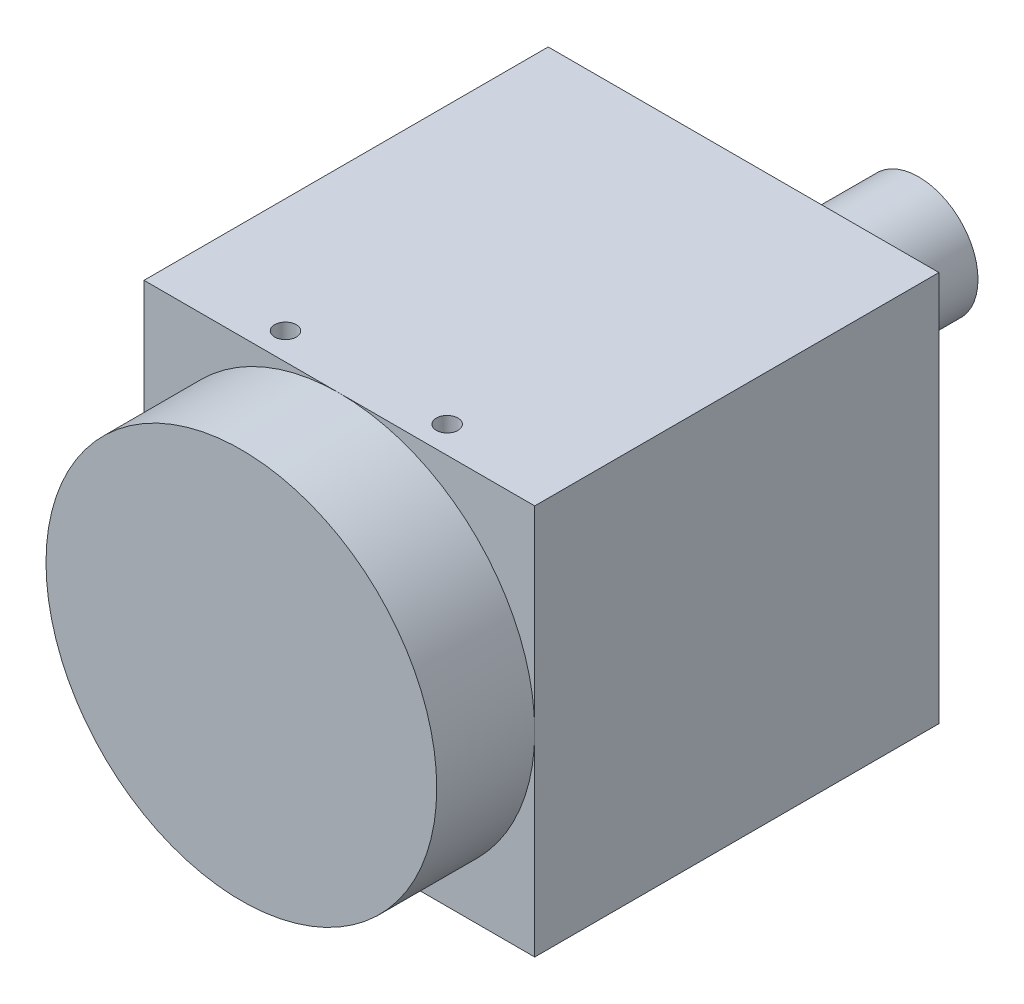
ISO-10303-21;
HEADER;
FILE_DESCRIPTION(('STEP AP214'),'2;1');
FILE_NAME('part.step','',(''),(''),'','','');
FILE_SCHEMA(('AUTOMOTIVE_DESIGN { 1 0 10303 214 1 1 1 1 }'));
ENDSEC;
DATA;
#1=APPLICATION_CONTEXT('core data for automotive mechanical design processes');
#2=APPLICATION_PROTOCOL_DEFINITION('international standard','automotive_design',2000,#1);
#3=PRODUCT_CONTEXT('',#1,'mechanical');
#4=PRODUCT('Part','Part','',(#3));
#5=PRODUCT_RELATED_PRODUCT_CATEGORY('part','',(#4));
#6=PRODUCT_DEFINITION_FORMATION('','',#4);
#7=PRODUCT_DEFINITION_CONTEXT('part definition',#1,'design');
#8=PRODUCT_DEFINITION('design','',#6,#7);
#9=PRODUCT_DEFINITION_SHAPE('','',#8);
#10=(LENGTH_UNIT() NAMED_UNIT(*) SI_UNIT(.MILLI.,.METRE.));
#11=(NAMED_UNIT(*) PLANE_ANGLE_UNIT() SI_UNIT($,.RADIAN.));
#12=(NAMED_UNIT(*) SI_UNIT($,.STERADIAN.) SOLID_ANGLE_UNIT());
#13=UNCERTAINTY_MEASURE_WITH_UNIT(LENGTH_MEASURE(1.E-05),#10,'distance_accuracy_value','');
#14=(GEOMETRIC_REPRESENTATION_CONTEXT(3) GLOBAL_UNCERTAINTY_ASSIGNED_CONTEXT((#13)) GLOBAL_UNIT_ASSIGNED_CONTEXT((#10,
#11,#12)) REPRESENTATION_CONTEXT('',''));
#15=CARTESIAN_POINT('',(0.,0.,0.));
#16=DIRECTION('',(0.,0.,1.));
#17=DIRECTION('',(1.,0.,0.));
#18=AXIS2_PLACEMENT_3D('',#15,#16,#17);
#19=CARTESIAN_POINT('',(0.,0.,15.));
#20=DIRECTION('',(0.,0.,1.));
#21=DIRECTION('',(1.,0.,0.));
#22=AXIS2_PLACEMENT_3D('',#19,#20,#21);
#23=PLANE('',#22);
#24=CARTESIAN_POINT('',(0.,0.,15.));
#25=DIRECTION('',(0.,0.,1.));
#26=DIRECTION('',(1.,0.,0.));
#27=AXIS2_PLACEMENT_3D('',#24,#25,#26);
#28=CIRCLE('',#27,14.5);
#29=CARTESIAN_POINT('',(14.5,0.,15.));
#30=VERTEX_POINT('',#29);
#31=CARTESIAN_POINT('',(0.,14.5,15.));
#32=VERTEX_POINT('',#31);
#33=EDGE_CURVE('E180',#30,#32,#28,.T.);
#34=ORIENTED_EDGE('',*,*,#33,.F.);
#35=DIRECTION('',(0.,1.,0.));
#36=VECTOR('',#35,1.);
#37=CARTESIAN_POINT('',(14.5,14.5,15.));
#38=LINE('',#37,#36);
#39=CARTESIAN_POINT('',(14.5,14.5,15.));
#40=VERTEX_POINT('',#39);
#41=EDGE_CURVE('E190',#30,#40,#38,.T.);
#42=ORIENTED_EDGE('',*,*,#41,.T.);
#43=DIRECTION('',(-1.,0.,0.));
#44=VECTOR('',#43,1.);
#45=CARTESIAN_POINT('',(-14.5,14.5,15.));
#46=LINE('',#45,#44);
#47=EDGE_CURVE('E191',#40,#32,#46,.T.);
#48=ORIENTED_EDGE('',*,*,#47,.T.);
#49=EDGE_LOOP('',(#34,#42,#48));
#50=FACE_BOUND('',#49,.T.);
#51=ADVANCED_FACE('F36',(#50),#23,.T.);
#52=CARTESIAN_POINT('',(-14.5,0.,15.));
#53=VERTEX_POINT('',#52);
#54=EDGE_CURVE('E44',#32,#53,#28,.T.);
#55=ORIENTED_EDGE('',*,*,#54,.F.);
#56=CARTESIAN_POINT('',(-14.5,14.5,15.));
#57=VERTEX_POINT('',#56);
#58=EDGE_CURVE('E189',#32,#57,#46,.T.);
#59=ORIENTED_EDGE('',*,*,#58,.T.);
#60=DIRECTION('',(0.,-1.,0.));
#61=VECTOR('',#60,1.);
#62=CARTESIAN_POINT('',(-14.5,14.5,15.));
#63=LINE('',#62,#61);
#64=EDGE_CURVE('E195',#57,#53,#63,.T.);
#65=ORIENTED_EDGE('',*,*,#64,.T.);
#66=EDGE_LOOP('',(#55,#59,#65));
#67=FACE_BOUND('',#66,.T.);
#68=ADVANCED_FACE('F228',(#67),#23,.T.);
#69=CARTESIAN_POINT('',(0.,-14.5,15.));
#70=VERTEX_POINT('',#69);
#71=EDGE_CURVE('E59',#53,#70,#28,.T.);
#72=ORIENTED_EDGE('',*,*,#71,.F.);
#73=CARTESIAN_POINT('',(-14.5,-14.5,15.));
#74=VERTEX_POINT('',#73);
#75=EDGE_CURVE('E194',#53,#74,#63,.T.);
#76=ORIENTED_EDGE('',*,*,#75,.T.);
#77=DIRECTION('',(1.,0.,0.));
#78=VECTOR('',#77,1.);
#79=CARTESIAN_POINT('',(-14.5,-14.5,15.));
#80=LINE('',#79,#78);
#81=EDGE_CURVE('E199',#74,#70,#80,.T.);
#82=ORIENTED_EDGE('',*,*,#81,.T.);
#83=EDGE_LOOP('',(#72,#76,#82));
#84=FACE_BOUND('',#83,.T.);
#85=ADVANCED_FACE('F246',(#84),#23,.T.);
#86=CARTESIAN_POINT('',(14.5,14.5,15.));
#87=DIRECTION('',(-1.,0.,0.));
#88=DIRECTION('',(0.,-1.,0.));
#89=AXIS2_PLACEMENT_3D('',#86,#87,#88);
#90=PLANE('',#89);
#91=DIRECTION('',(0.,1.,0.));
#92=VECTOR('',#91,1.);
#93=CARTESIAN_POINT('',(14.5,14.5,-15.));
#94=LINE('',#93,#92);
#95=CARTESIAN_POINT('',(14.5,-14.5,-15.));
#96=VERTEX_POINT('',#95);
#97=CARTESIAN_POINT('',(14.5,14.5,-15.));
#98=VERTEX_POINT('',#97);
#99=EDGE_CURVE('E184',#96,#98,#94,.T.);
#100=ORIENTED_EDGE('',*,*,#99,.T.);
#101=DIRECTION('',(0.,0.,-1.));
#102=VECTOR('',#101,1.);
#103=CARTESIAN_POINT('',(14.5,14.5,15.));
#104=LINE('',#103,#102);
#105=EDGE_CURVE('E217',#40,#98,#104,.T.);
#106=ORIENTED_EDGE('',*,*,#105,.F.);
#107=ORIENTED_EDGE('',*,*,#41,.F.);
#108=CARTESIAN_POINT('',(14.5,-14.5,15.));
#109=VERTEX_POINT('',#108);
#110=EDGE_CURVE('E187',#109,#30,#38,.T.);
#111=ORIENTED_EDGE('',*,*,#110,.F.);
#112=DIRECTION('',(0.,0.,-1.));
#113=VECTOR('',#112,1.);
#114=CARTESIAN_POINT('',(14.5,-14.5,15.));
#115=LINE('',#114,#113);
#116=EDGE_CURVE('E201',#109,#96,#115,.T.);
#117=ORIENTED_EDGE('',*,*,#116,.T.);
#118=EDGE_LOOP('',(#100,#106,#107,#111,#117));
#119=FACE_BOUND('',#118,.T.);
#120=ADVANCED_FACE('F38',(#119),#90,.F.);
#121=CARTESIAN_POINT('',(-14.5,14.5,15.));
#122=DIRECTION('',(0.,-1.,0.));
#123=DIRECTION('',(0.,0.,-1.));
#124=AXIS2_PLACEMENT_3D('',#121,#122,#123);
#125=PLANE('',#124);
#126=CARTESIAN_POINT('',(-6.,14.5,13.));
#127=DIRECTION('',(0.,1.,0.));
#128=DIRECTION('',(0.,0.,1.));
#129=AXIS2_PLACEMENT_3D('',#126,#127,#128);
#130=CIRCLE('',#129,0.79999999999999);
#131=CARTESIAN_POINT('',(-6.,14.5,13.8));
#132=VERTEX_POINT('',#131);
#133=EDGE_CURVE('E168',#132,#132,#130,.T.);
#134=ORIENTED_EDGE('',*,*,#133,.F.);
#135=EDGE_LOOP('',(#134));
#136=FACE_BOUND('',#135,.T.);
#137=CARTESIAN_POINT('',(6.,14.5,13.));
#138=DIRECTION('',(0.,1.,0.));
#139=DIRECTION('',(0.,0.,1.));
#140=AXIS2_PLACEMENT_3D('',#137,#138,#139);
#141=CIRCLE('',#140,0.79999999999999);
#142=CARTESIAN_POINT('',(6.,14.5,13.8));
#143=VERTEX_POINT('',#142);
#144=EDGE_CURVE('E174',#143,#143,#141,.T.);
#145=ORIENTED_EDGE('',*,*,#144,.F.);
#146=EDGE_LOOP('',(#145));
#147=FACE_BOUND('',#146,.T.);
#148=DIRECTION('',(-1.,0.,0.));
#149=VECTOR('',#148,1.);
#150=CARTESIAN_POINT('',(-14.5,14.5,-15.));
#151=LINE('',#150,#149);
#152=CARTESIAN_POINT('',(-14.5,14.5,-15.));
#153=VERTEX_POINT('',#152);
#154=EDGE_CURVE('E204',#98,#153,#151,.T.);
#155=ORIENTED_EDGE('',*,*,#154,.T.);
#156=DIRECTION('',(0.,0.,-1.));
#157=VECTOR('',#156,1.);
#158=CARTESIAN_POINT('',(-14.5,14.5,15.));
#159=LINE('',#158,#157);
#160=EDGE_CURVE('E215',#57,#153,#159,.T.);
#161=ORIENTED_EDGE('',*,*,#160,.F.);
#162=ORIENTED_EDGE('',*,*,#58,.F.);
#163=ORIENTED_EDGE('',*,*,#47,.F.);
#164=ORIENTED_EDGE('',*,*,#105,.T.);
#165=EDGE_LOOP('',(#155,#161,#162,#163,#164));
#166=FACE_BOUND('',#165,.T.);
#167=ADVANCED_FACE('F231',(#136,#147,#166),#125,.F.);
#168=CARTESIAN_POINT('',(-14.5,14.5,15.));
#169=DIRECTION('',(1.,0.,0.));
#170=DIRECTION('',(0.,1.,0.));
#171=AXIS2_PLACEMENT_3D('',#168,#169,#170);
#172=PLANE('',#171);
#173=DIRECTION('',(0.,-1.,0.));
#174=VECTOR('',#173,1.);
#175=CARTESIAN_POINT('',(-14.5,14.5,-15.));
#176=LINE('',#175,#174);
#177=CARTESIAN_POINT('',(-14.5,-14.5,-15.));
#178=VERTEX_POINT('',#177);
#179=EDGE_CURVE('E206',#153,#178,#176,.T.);
#180=ORIENTED_EDGE('',*,*,#179,.T.);
#181=DIRECTION('',(0.,0.,-1.));
#182=VECTOR('',#181,1.);
#183=CARTESIAN_POINT('',(-14.5,-14.5,15.));
#184=LINE('',#183,#182);
#185=EDGE_CURVE('E212',#74,#178,#184,.T.);
#186=ORIENTED_EDGE('',*,*,#185,.F.);
#187=ORIENTED_EDGE('',*,*,#75,.F.);
#188=ORIENTED_EDGE('',*,*,#64,.F.);
#189=ORIENTED_EDGE('',*,*,#160,.T.);
#190=EDGE_LOOP('',(#180,#186,#187,#188,#189));
#191=FACE_BOUND('',#190,.T.);
#192=ADVANCED_FACE('F243',(#191),#172,.F.);
#193=CARTESIAN_POINT('',(-14.5,-14.5,15.));
#194=DIRECTION('',(0.,1.,0.));
#195=DIRECTION('',(0.,0.,1.));
#196=AXIS2_PLACEMENT_3D('',#193,#194,#195);
#197=PLANE('',#196);
#198=CARTESIAN_POINT('',(0.,-14.5,-11.7));
#199=DIRECTION('',(0.,-1.,0.));
#200=DIRECTION('',(0.,0.,-1.));
#201=AXIS2_PLACEMENT_3D('',#198,#199,#200);
#202=CIRCLE('',#201,1.25);
#203=CARTESIAN_POINT('',(0.,-14.5,-12.95));
#204=VERTEX_POINT('',#203);
#205=EDGE_CURVE('E126',#204,#204,#202,.T.);
#206=ORIENTED_EDGE('',*,*,#205,.F.);
#207=EDGE_LOOP('',(#206));
#208=FACE_BOUND('',#207,.T.);
#209=CARTESIAN_POINT('',(10.,-14.5,12.));
#210=DIRECTION('',(0.,-1.,0.));
#211=DIRECTION('',(0.,0.,-1.));
#212=AXIS2_PLACEMENT_3D('',#209,#210,#211);
#213=CIRCLE('',#212,1.25);
#214=CARTESIAN_POINT('',(10.,-14.5,10.75));
#215=VERTEX_POINT('',#214);
#216=EDGE_CURVE('E125',#215,#215,#213,.T.);
#217=ORIENTED_EDGE('',*,*,#216,.F.);
#218=EDGE_LOOP('',(#217));
#219=FACE_BOUND('',#218,.T.);
#220=CARTESIAN_POINT('',(-10.,-14.5,12.));
#221=DIRECTION('',(0.,-1.,0.));
#222=DIRECTION('',(0.,0.,-1.));
#223=AXIS2_PLACEMENT_3D('',#220,#221,#222);
#224=CIRCLE('',#223,1.25);
#225=CARTESIAN_POINT('',(-10.,-14.5,10.75));
#226=VERTEX_POINT('',#225);
#227=EDGE_CURVE('E138',#226,#226,#224,.T.);
#228=ORIENTED_EDGE('',*,*,#227,.F.);
#229=EDGE_LOOP('',(#228));
#230=FACE_BOUND('',#229,.T.);
#231=CARTESIAN_POINT('',(-6.,-14.5,10.5));
#232=DIRECTION('',(0.,-1.,0.));
#233=DIRECTION('',(0.,0.,-1.));
#234=AXIS2_PLACEMENT_3D('',#231,#232,#233);
#235=CIRCLE('',#234,0.79999999999999);
#236=CARTESIAN_POINT('',(-6.,-14.5,9.70000000000001));
#237=VERTEX_POINT('',#236);
#238=EDGE_CURVE('E144',#237,#237,#235,.T.);
#239=ORIENTED_EDGE('',*,*,#238,.F.);
#240=EDGE_LOOP('',(#239));
#241=FACE_BOUND('',#240,.T.);
#242=CARTESIAN_POINT('',(6.,-14.5,10.5));
#243=DIRECTION('',(0.,-1.,0.));
#244=DIRECTION('',(0.,0.,-1.));
#245=AXIS2_PLACEMENT_3D('',#242,#243,#244);
#246=CIRCLE('',#245,0.79999999999999);
#247=CARTESIAN_POINT('',(6.,-14.5,9.70000000000001));
#248=VERTEX_POINT('',#247);
#249=EDGE_CURVE('E150',#248,#248,#246,.T.);
#250=ORIENTED_EDGE('',*,*,#249,.F.);
#251=EDGE_LOOP('',(#250));
#252=FACE_BOUND('',#251,.T.);
#253=CARTESIAN_POINT('',(-5.99999999999999,-14.5,-11.7));
#254=DIRECTION('',(0.,-1.,0.));
#255=DIRECTION('',(0.,0.,-1.));
#256=AXIS2_PLACEMENT_3D('',#253,#254,#255);
#257=CIRCLE('',#256,0.79999999999999);
#258=CARTESIAN_POINT('',(-5.99999999999999,-14.5,-12.5));
#259=VERTEX_POINT('',#258);
#260=EDGE_CURVE('E156',#259,#259,#257,.T.);
#261=ORIENTED_EDGE('',*,*,#260,.F.);
#262=EDGE_LOOP('',(#261));
#263=FACE_BOUND('',#262,.T.);
#264=CARTESIAN_POINT('',(6.,-14.5,-11.7));
#265=DIRECTION('',(0.,-1.,0.));
#266=DIRECTION('',(0.,0.,-1.));
#267=AXIS2_PLACEMENT_3D('',#264,#265,#266);
#268=CIRCLE('',#267,0.79999999999999);
#269=CARTESIAN_POINT('',(6.,-14.5,-12.5));
#270=VERTEX_POINT('',#269);
#271=EDGE_CURVE('E162',#270,#270,#268,.T.);
#272=ORIENTED_EDGE('',*,*,#271,.F.);
#273=EDGE_LOOP('',(#272));
#274=FACE_BOUND('',#273,.T.);
#275=DIRECTION('',(1.,0.,0.));
#276=VECTOR('',#275,1.);
#277=CARTESIAN_POINT('',(-14.5,-14.5,-15.));
#278=LINE('',#277,#276);
#279=EDGE_CURVE('E208',#178,#96,#278,.T.);
#280=ORIENTED_EDGE('',*,*,#279,.T.);
#281=ORIENTED_EDGE('',*,*,#116,.F.);
#282=EDGE_CURVE('E198',#70,#109,#80,.T.);
#283=ORIENTED_EDGE('',*,*,#282,.F.);
#284=ORIENTED_EDGE('',*,*,#81,.F.);
#285=ORIENTED_EDGE('',*,*,#185,.T.);
#286=EDGE_LOOP('',(#280,#281,#283,#284,#285));
#287=FACE_BOUND('',#286,.T.);
#288=ADVANCED_FACE('F248',(#208,#219,#230,#241,#252,#263,#274,#287),#197,.F.);
#289=EDGE_CURVE('E51',#70,#30,#28,.T.);
#290=ORIENTED_EDGE('',*,*,#289,.F.);
#291=ORIENTED_EDGE('',*,*,#282,.T.);
#292=ORIENTED_EDGE('',*,*,#110,.T.);
#293=EDGE_LOOP('',(#290,#291,#292));
#294=FACE_BOUND('',#293,.T.);
#295=ADVANCED_FACE('F249',(#294),#23,.T.);
#296=CARTESIAN_POINT('',(0.,0.,-15.));
#297=DIRECTION('',(0.,0.,1.));
#298=DIRECTION('',(1.,0.,0.));
#299=AXIS2_PLACEMENT_3D('',#296,#297,#298);
#300=PLANE('',#299);
#301=CARTESIAN_POINT('',(6.5,9.,-15.));
#302=DIRECTION('',(0.,0.,1.));
#303=DIRECTION('',(1.,0.,0.));
#304=AXIS2_PLACEMENT_3D('',#301,#302,#303);
#305=CIRCLE('',#304,4.4);
#306=CARTESIAN_POINT('',(10.9,9.,-15.));
#307=VERTEX_POINT('',#306);
#308=EDGE_CURVE('E11',#307,#307,#305,.F.);
#309=ORIENTED_EDGE('',*,*,#308,.F.);
#310=EDGE_LOOP('',(#309));
#311=FACE_BOUND('',#310,.T.);
#312=ORIENTED_EDGE('',*,*,#99,.F.);
#313=ORIENTED_EDGE('',*,*,#279,.F.);
#314=ORIENTED_EDGE('',*,*,#179,.F.);
#315=ORIENTED_EDGE('',*,*,#154,.F.);
#316=EDGE_LOOP('',(#312,#313,#314,#315));
#317=FACE_BOUND('',#316,.T.);
#318=ADVANCED_FACE('F240',(#311,#317),#300,.F.);
#319=CARTESIAN_POINT('',(0.,0.,22.274));
#320=DIRECTION('',(0.,0.,-1.));
#321=DIRECTION('',(-1.,0.,0.));
#322=AXIS2_PLACEMENT_3D('',#319,#320,#321);
#323=CYLINDRICAL_SURFACE('',#322,14.5);
#324=CARTESIAN_POINT('',(0.,0.,22.274));
#325=DIRECTION('',(0.,0.,1.));
#326=DIRECTION('',(1.,0.,0.));
#327=AXIS2_PLACEMENT_3D('',#324,#325,#326);
#328=CIRCLE('',#327,14.5);
#329=CARTESIAN_POINT('',(14.5,0.,22.274));
#330=VERTEX_POINT('',#329);
#331=EDGE_CURVE('E181',#330,#330,#328,.T.);
#332=ORIENTED_EDGE('',*,*,#331,.F.);
#333=EDGE_LOOP('',(#332));
#334=FACE_BOUND('',#333,.T.);
#335=ORIENTED_EDGE('',*,*,#33,.T.);
#336=ORIENTED_EDGE('',*,*,#54,.T.);
#337=ORIENTED_EDGE('',*,*,#71,.T.);
#338=ORIENTED_EDGE('',*,*,#289,.T.);
#339=EDGE_LOOP('',(#335,#336,#337,#338));
#340=FACE_BOUND('',#339,.T.);
#341=ADVANCED_FACE('F224',(#334,#340),#323,.T.);
#342=CARTESIAN_POINT('',(0.,0.,22.274));
#343=DIRECTION('',(0.,0.,1.));
#344=DIRECTION('',(1.,0.,0.));
#345=AXIS2_PLACEMENT_3D('',#342,#343,#344);
#346=PLANE('',#345);
#347=ORIENTED_EDGE('',*,*,#331,.T.);
#348=EDGE_LOOP('',(#347));
#349=FACE_BOUND('',#348,.T.);
#350=ADVANCED_FACE('F286',(#349),#346,.T.);
#351=CARTESIAN_POINT('',(6.,12.,13.));
#352=DIRECTION('',(0.,1.,0.));
#353=DIRECTION('',(0.,0.,1.));
#354=AXIS2_PLACEMENT_3D('',#351,#352,#353);
#355=CONICAL_SURFACE('',#354,0.799999999999999,1.02974425867665);
#356=CARTESIAN_POINT('',(6.,11.519311504778,13.));
#357=VERTEX_POINT('',#356);
#358=VERTEX_LOOP('',#357);
#359=FACE_BOUND('',#358,.T.);
#360=CARTESIAN_POINT('',(6.,12.,13.));
#361=DIRECTION('',(0.,1.,0.));
#362=DIRECTION('',(0.,0.,1.));
#363=AXIS2_PLACEMENT_3D('',#360,#361,#362);
#364=CIRCLE('',#363,0.799999999999999);
#365=CARTESIAN_POINT('',(6.,12.,13.8));
#366=VERTEX_POINT('',#365);
#367=EDGE_CURVE('E177',#366,#366,#364,.T.);
#368=ORIENTED_EDGE('',*,*,#367,.T.);
#369=EDGE_LOOP('',(#368));
#370=FACE_BOUND('',#369,.T.);
#371=ADVANCED_FACE('F294',(#359,#370),#355,.F.);
#372=CARTESIAN_POINT('',(6.,14.5,13.));
#373=DIRECTION('',(0.,1.,0.));
#374=DIRECTION('',(0.,0.,1.));
#375=AXIS2_PLACEMENT_3D('',#372,#373,#374);
#376=CYLINDRICAL_SURFACE('',#375,0.799999999999994);
#377=ORIENTED_EDGE('',*,*,#367,.F.);
#378=EDGE_LOOP('',(#377));
#379=FACE_BOUND('',#378,.T.);
#380=ORIENTED_EDGE('',*,*,#144,.T.);
#381=EDGE_LOOP('',(#380));
#382=FACE_BOUND('',#381,.T.);
#383=ADVANCED_FACE('F304',(#379,#382),#376,.F.);
#384=CARTESIAN_POINT('',(-6.,12.,13.));
#385=DIRECTION('',(0.,1.,0.));
#386=DIRECTION('',(0.,0.,1.));
#387=AXIS2_PLACEMENT_3D('',#384,#385,#386);
#388=CONICAL_SURFACE('',#387,0.799999999999999,1.02974425867665);
#389=CARTESIAN_POINT('',(-6.,11.519311504778,13.));
#390=VERTEX_POINT('',#389);
#391=VERTEX_LOOP('',#390);
#392=FACE_BOUND('',#391,.T.);
#393=CARTESIAN_POINT('',(-6.,12.,13.));
#394=DIRECTION('',(0.,1.,0.));
#395=DIRECTION('',(0.,0.,1.));
#396=AXIS2_PLACEMENT_3D('',#393,#394,#395);
#397=CIRCLE('',#396,0.799999999999999);
#398=CARTESIAN_POINT('',(-6.,12.,13.8));
#399=VERTEX_POINT('',#398);
#400=EDGE_CURVE('E171',#399,#399,#397,.T.);
#401=ORIENTED_EDGE('',*,*,#400,.T.);
#402=EDGE_LOOP('',(#401));
#403=FACE_BOUND('',#402,.T.);
#404=ADVANCED_FACE('F313',(#392,#403),#388,.F.);
#405=CARTESIAN_POINT('',(-6.,14.5,13.));
#406=DIRECTION('',(0.,1.,0.));
#407=DIRECTION('',(0.,0.,1.));
#408=AXIS2_PLACEMENT_3D('',#405,#406,#407);
#409=CYLINDRICAL_SURFACE('',#408,0.799999999999994);
#410=ORIENTED_EDGE('',*,*,#400,.F.);
#411=EDGE_LOOP('',(#410));
#412=FACE_BOUND('',#411,.T.);
#413=ORIENTED_EDGE('',*,*,#133,.T.);
#414=EDGE_LOOP('',(#413));
#415=FACE_BOUND('',#414,.T.);
#416=ADVANCED_FACE('F323',(#412,#415),#409,.F.);
#417=CARTESIAN_POINT('',(6.,-12.5,-11.7));
#418=DIRECTION('',(0.,-1.,0.));
#419=DIRECTION('',(0.,0.,-1.));
#420=AXIS2_PLACEMENT_3D('',#417,#418,#419);
#421=CONICAL_SURFACE('',#420,0.799999999999999,1.02974425867665);
#422=CARTESIAN_POINT('',(6.,-12.0193115047779,-11.7));
#423=VERTEX_POINT('',#422);
#424=VERTEX_LOOP('',#423);
#425=FACE_BOUND('',#424,.T.);
#426=CARTESIAN_POINT('',(6.,-12.5,-11.7));
#427=DIRECTION('',(0.,-1.,0.));
#428=DIRECTION('',(0.,0.,-1.));
#429=AXIS2_PLACEMENT_3D('',#426,#427,#428);
#430=CIRCLE('',#429,0.799999999999999);
#431=CARTESIAN_POINT('',(6.,-12.5,-12.5));
#432=VERTEX_POINT('',#431);
#433=EDGE_CURVE('E165',#432,#432,#430,.T.);
#434=ORIENTED_EDGE('',*,*,#433,.T.);
#435=EDGE_LOOP('',(#434));
#436=FACE_BOUND('',#435,.T.);
#437=ADVANCED_FACE('F332',(#425,#436),#421,.F.);
#438=CARTESIAN_POINT('',(6.,-14.5,-11.7));
#439=DIRECTION('',(0.,-1.,0.));
#440=DIRECTION('',(0.,0.,-1.));
#441=AXIS2_PLACEMENT_3D('',#438,#439,#440);
#442=CYLINDRICAL_SURFACE('',#441,0.799999999999995);
#443=ORIENTED_EDGE('',*,*,#433,.F.);
#444=EDGE_LOOP('',(#443));
#445=FACE_BOUND('',#444,.T.);
#446=ORIENTED_EDGE('',*,*,#271,.T.);
#447=EDGE_LOOP('',(#446));
#448=FACE_BOUND('',#447,.T.);
#449=ADVANCED_FACE('F342',(#445,#448),#442,.F.);
#450=CARTESIAN_POINT('',(-5.99999999999999,-12.5,-11.7));
#451=DIRECTION('',(0.,-1.,0.));
#452=DIRECTION('',(0.,0.,-1.));
#453=AXIS2_PLACEMENT_3D('',#450,#451,#452);
#454=CONICAL_SURFACE('',#453,0.799999999999999,1.02974425867665);
#455=CARTESIAN_POINT('',(-5.99999999999999,-12.0193115047779,-11.7));
#456=VERTEX_POINT('',#455);
#457=VERTEX_LOOP('',#456);
#458=FACE_BOUND('',#457,.T.);
#459=CARTESIAN_POINT('',(-5.99999999999999,-12.5,-11.7));
#460=DIRECTION('',(0.,-1.,0.));
#461=DIRECTION('',(0.,0.,-1.));
#462=AXIS2_PLACEMENT_3D('',#459,#460,#461);
#463=CIRCLE('',#462,0.799999999999999);
#464=CARTESIAN_POINT('',(-5.99999999999999,-12.5,-12.5));
#465=VERTEX_POINT('',#464);
#466=EDGE_CURVE('E159',#465,#465,#463,.T.);
#467=ORIENTED_EDGE('',*,*,#466,.T.);
#468=EDGE_LOOP('',(#467));
#469=FACE_BOUND('',#468,.T.);
#470=ADVANCED_FACE('F351',(#458,#469),#454,.F.);
#471=CARTESIAN_POINT('',(-5.99999999999999,-14.5,-11.7));
#472=DIRECTION('',(0.,-1.,0.));
#473=DIRECTION('',(0.,0.,-1.));
#474=AXIS2_PLACEMENT_3D('',#471,#472,#473);
#475=CYLINDRICAL_SURFACE('',#474,0.799999999999995);
#476=ORIENTED_EDGE('',*,*,#466,.F.);
#477=EDGE_LOOP('',(#476));
#478=FACE_BOUND('',#477,.T.);
#479=ORIENTED_EDGE('',*,*,#260,.T.);
#480=EDGE_LOOP('',(#479));
#481=FACE_BOUND('',#480,.T.);
#482=ADVANCED_FACE('F361',(#478,#481),#475,.F.);
#483=CARTESIAN_POINT('',(6.,-12.,10.5));
#484=DIRECTION('',(0.,-1.,0.));
#485=DIRECTION('',(0.,0.,-1.));
#486=AXIS2_PLACEMENT_3D('',#483,#484,#485);
#487=CONICAL_SURFACE('',#486,0.799999999999999,1.02974425867665);
#488=CARTESIAN_POINT('',(6.,-11.5193115047779,10.5));
#489=VERTEX_POINT('',#488);
#490=VERTEX_LOOP('',#489);
#491=FACE_BOUND('',#490,.T.);
#492=CARTESIAN_POINT('',(6.,-12.,10.5));
#493=DIRECTION('',(0.,-1.,0.));
#494=DIRECTION('',(0.,0.,-1.));
#495=AXIS2_PLACEMENT_3D('',#492,#493,#494);
#496=CIRCLE('',#495,0.799999999999999);
#497=CARTESIAN_POINT('',(6.,-12.,9.7));
#498=VERTEX_POINT('',#497);
#499=EDGE_CURVE('E153',#498,#498,#496,.T.);
#500=ORIENTED_EDGE('',*,*,#499,.T.);
#501=EDGE_LOOP('',(#500));
#502=FACE_BOUND('',#501,.T.);
#503=ADVANCED_FACE('F370',(#491,#502),#487,.F.);
#504=CARTESIAN_POINT('',(6.,-14.5,10.5));
#505=DIRECTION('',(0.,-1.,0.));
#506=DIRECTION('',(0.,0.,-1.));
#507=AXIS2_PLACEMENT_3D('',#504,#505,#506);
#508=CYLINDRICAL_SURFACE('',#507,0.799999999999995);
#509=ORIENTED_EDGE('',*,*,#499,.F.);
#510=EDGE_LOOP('',(#509));
#511=FACE_BOUND('',#510,.T.);
#512=ORIENTED_EDGE('',*,*,#249,.T.);
#513=EDGE_LOOP('',(#512));
#514=FACE_BOUND('',#513,.T.);
#515=ADVANCED_FACE('F380',(#511,#514),#508,.F.);
#516=CARTESIAN_POINT('',(-6.,-12.,10.5));
#517=DIRECTION('',(0.,-1.,0.));
#518=DIRECTION('',(0.,0.,-1.));
#519=AXIS2_PLACEMENT_3D('',#516,#517,#518);
#520=CONICAL_SURFACE('',#519,0.799999999999999,1.02974425867665);
#521=CARTESIAN_POINT('',(-6.,-11.5193115047779,10.5));
#522=VERTEX_POINT('',#521);
#523=VERTEX_LOOP('',#522);
#524=FACE_BOUND('',#523,.T.);
#525=CARTESIAN_POINT('',(-6.,-12.,10.5));
#526=DIRECTION('',(0.,-1.,0.));
#527=DIRECTION('',(0.,0.,-1.));
#528=AXIS2_PLACEMENT_3D('',#525,#526,#527);
#529=CIRCLE('',#528,0.799999999999999);
#530=CARTESIAN_POINT('',(-6.,-12.,9.7));
#531=VERTEX_POINT('',#530);
#532=EDGE_CURVE('E147',#531,#531,#529,.T.);
#533=ORIENTED_EDGE('',*,*,#532,.T.);
#534=EDGE_LOOP('',(#533));
#535=FACE_BOUND('',#534,.T.);
#536=ADVANCED_FACE('F389',(#524,#535),#520,.F.);
#537=CARTESIAN_POINT('',(-6.,-14.5,10.5));
#538=DIRECTION('',(0.,-1.,0.));
#539=DIRECTION('',(0.,0.,-1.));
#540=AXIS2_PLACEMENT_3D('',#537,#538,#539);
#541=CYLINDRICAL_SURFACE('',#540,0.799999999999995);
#542=ORIENTED_EDGE('',*,*,#532,.F.);
#543=EDGE_LOOP('',(#542));
#544=FACE_BOUND('',#543,.T.);
#545=ORIENTED_EDGE('',*,*,#238,.T.);
#546=EDGE_LOOP('',(#545));
#547=FACE_BOUND('',#546,.T.);
#548=ADVANCED_FACE('F399',(#544,#547),#541,.F.);
#549=CARTESIAN_POINT('',(-10.,-11.7,12.));
#550=DIRECTION('',(0.,-1.,0.));
#551=DIRECTION('',(0.,0.,-1.));
#552=AXIS2_PLACEMENT_3D('',#549,#550,#551);
#553=CONICAL_SURFACE('',#552,1.25,1.02974425867665);
#554=CARTESIAN_POINT('',(-10.,-10.9489242262155,12.));
#555=VERTEX_POINT('',#554);
#556=VERTEX_LOOP('',#555);
#557=FACE_BOUND('',#556,.T.);
#558=CARTESIAN_POINT('',(-10.,-11.7,12.));
#559=DIRECTION('',(0.,-1.,0.));
#560=DIRECTION('',(0.,0.,-1.));
#561=AXIS2_PLACEMENT_3D('',#558,#559,#560);
#562=CIRCLE('',#561,1.25);
#563=CARTESIAN_POINT('',(-10.,-11.7,10.75));
#564=VERTEX_POINT('',#563);
#565=EDGE_CURVE('E141',#564,#564,#562,.T.);
#566=ORIENTED_EDGE('',*,*,#565,.T.);
#567=EDGE_LOOP('',(#566));
#568=FACE_BOUND('',#567,.T.);
#569=ADVANCED_FACE('F408',(#557,#568),#553,.F.);
#570=CARTESIAN_POINT('',(-10.,-14.5,12.));
#571=DIRECTION('',(0.,-1.,0.));
#572=DIRECTION('',(0.,0.,-1.));
#573=AXIS2_PLACEMENT_3D('',#570,#571,#572);
#574=CYLINDRICAL_SURFACE('',#573,1.25);
#575=ORIENTED_EDGE('',*,*,#565,.F.);
#576=EDGE_LOOP('',(#575));
#577=FACE_BOUND('',#576,.T.);
#578=ORIENTED_EDGE('',*,*,#227,.T.);
#579=EDGE_LOOP('',(#578));
#580=FACE_BOUND('',#579,.T.);
#581=ADVANCED_FACE('F418',(#577,#580),#574,.F.);
#582=CARTESIAN_POINT('',(10.,-11.7,12.));
#583=DIRECTION('',(0.,-1.,0.));
#584=DIRECTION('',(0.,0.,-1.));
#585=AXIS2_PLACEMENT_3D('',#582,#583,#584);
#586=CONICAL_SURFACE('',#585,1.25,1.02974425867665);
#587=CARTESIAN_POINT('',(10.,-10.9489242262155,12.));
#588=VERTEX_POINT('',#587);
#589=VERTEX_LOOP('',#588);
#590=FACE_BOUND('',#589,.T.);
#591=CARTESIAN_POINT('',(10.,-11.7,12.));
#592=DIRECTION('',(0.,-1.,0.));
#593=DIRECTION('',(0.,0.,-1.));
#594=AXIS2_PLACEMENT_3D('',#591,#592,#593);
#595=CIRCLE('',#594,1.25);
#596=CARTESIAN_POINT('',(10.,-11.7,10.75));
#597=VERTEX_POINT('',#596);
#598=EDGE_CURVE('E129',#597,#597,#595,.T.);
#599=ORIENTED_EDGE('',*,*,#598,.T.);
#600=EDGE_LOOP('',(#599));
#601=FACE_BOUND('',#600,.T.);
#602=ADVANCED_FACE('F427',(#590,#601),#586,.F.);
#603=CARTESIAN_POINT('',(10.,-14.5,12.));
#604=DIRECTION('',(0.,-1.,0.));
#605=DIRECTION('',(0.,0.,-1.));
#606=AXIS2_PLACEMENT_3D('',#603,#604,#605);
#607=CYLINDRICAL_SURFACE('',#606,1.25);
#608=ORIENTED_EDGE('',*,*,#598,.F.);
#609=EDGE_LOOP('',(#608));
#610=FACE_BOUND('',#609,.T.);
#611=ORIENTED_EDGE('',*,*,#216,.T.);
#612=EDGE_LOOP('',(#611));
#613=FACE_BOUND('',#612,.T.);
#614=ADVANCED_FACE('F119',(#610,#613),#607,.F.);
#615=CARTESIAN_POINT('',(0.,-12.,-11.7));
#616=DIRECTION('',(0.,-1.,0.));
#617=DIRECTION('',(0.,0.,-1.));
#618=AXIS2_PLACEMENT_3D('',#615,#616,#617);
#619=CONICAL_SURFACE('',#618,1.25,1.02974425867665);
#620=CARTESIAN_POINT('',(0.,-11.2489242262155,-11.7));
#621=VERTEX_POINT('',#620);
#622=VERTEX_LOOP('',#621);
#623=FACE_BOUND('',#622,.T.);
#624=CARTESIAN_POINT('',(0.,-12.,-11.7));
#625=DIRECTION('',(0.,-1.,0.));
#626=DIRECTION('',(0.,0.,-1.));
#627=AXIS2_PLACEMENT_3D('',#624,#625,#626);
#628=CIRCLE('',#627,1.25);
#629=CARTESIAN_POINT('',(0.,-12.,-12.95));
#630=VERTEX_POINT('',#629);
#631=EDGE_CURVE('E123',#630,#630,#628,.T.);
#632=ORIENTED_EDGE('',*,*,#631,.T.);
#633=EDGE_LOOP('',(#632));
#634=FACE_BOUND('',#633,.T.);
#635=ADVANCED_FACE('F115',(#623,#634),#619,.F.);
#636=CARTESIAN_POINT('',(0.,-14.5,-11.7));
#637=DIRECTION('',(0.,-1.,0.));
#638=DIRECTION('',(0.,0.,-1.));
#639=AXIS2_PLACEMENT_3D('',#636,#637,#638);
#640=CYLINDRICAL_SURFACE('',#639,1.25);
#641=ORIENTED_EDGE('',*,*,#631,.F.);
#642=EDGE_LOOP('',(#641));
#643=FACE_BOUND('',#642,.T.);
#644=ORIENTED_EDGE('',*,*,#205,.T.);
#645=EDGE_LOOP('',(#644));
#646=FACE_BOUND('',#645,.T.);
#647=ADVANCED_FACE('F118',(#643,#646),#640,.F.);
#648=CARTESIAN_POINT('',(6.5,9.,-21.5));
#649=DIRECTION('',(0.,0.,1.));
#650=DIRECTION('',(1.,0.,0.));
#651=AXIS2_PLACEMENT_3D('',#648,#649,#650);
#652=CYLINDRICAL_SURFACE('',#651,4.4);
#653=CARTESIAN_POINT('',(6.5,9.,-21.5));
#654=DIRECTION('',(0.,0.,-1.));
#655=DIRECTION('',(-1.,0.,0.));
#656=AXIS2_PLACEMENT_3D('',#653,#654,#655);
#657=CIRCLE('',#656,4.4);
#658=CARTESIAN_POINT('',(2.1,9.,-21.5));
#659=VERTEX_POINT('',#658);
#660=EDGE_CURVE('E132',#659,#659,#657,.T.);
#661=ORIENTED_EDGE('',*,*,#660,.F.);
#662=EDGE_LOOP('',(#661));
#663=FACE_BOUND('',#662,.T.);
#664=ORIENTED_EDGE('',*,*,#308,.T.);
#665=EDGE_LOOP('',(#664));
#666=FACE_BOUND('',#665,.T.);
#667=ADVANCED_FACE('F460',(#663,#666),#652,.T.);
#668=CARTESIAN_POINT('',(6.5,9.,-21.5));
#669=DIRECTION('',(0.,0.,-1.));
#670=DIRECTION('',(-1.,0.,0.));
#671=AXIS2_PLACEMENT_3D('',#668,#669,#670);
#672=PLANE('',#671);
#673=ORIENTED_EDGE('',*,*,#660,.T.);
#674=EDGE_LOOP('',(#673));
#675=FACE_BOUND('',#674,.T.);
#676=ADVANCED_FACE('F470',(#675),#672,.T.);
#677=CLOSED_SHELL('',(#51,#68,#85,#120,#167,#192,#288,#295,#318,#341,#350,#371,#383,#404,#416,
#437,#449,#470,#482,#503,#515,#536,#548,#569,#581,#602,#614,#635,#647,#667,#676));
#678=MANIFOLD_SOLID_BREP('B2',#677);
#679=ADVANCED_BREP_SHAPE_REPRESENTATION('',(#18,#678),#14);
#680=SHAPE_DEFINITION_REPRESENTATION(#9,#679);
ENDSEC;
END-ISO-10303-21;
